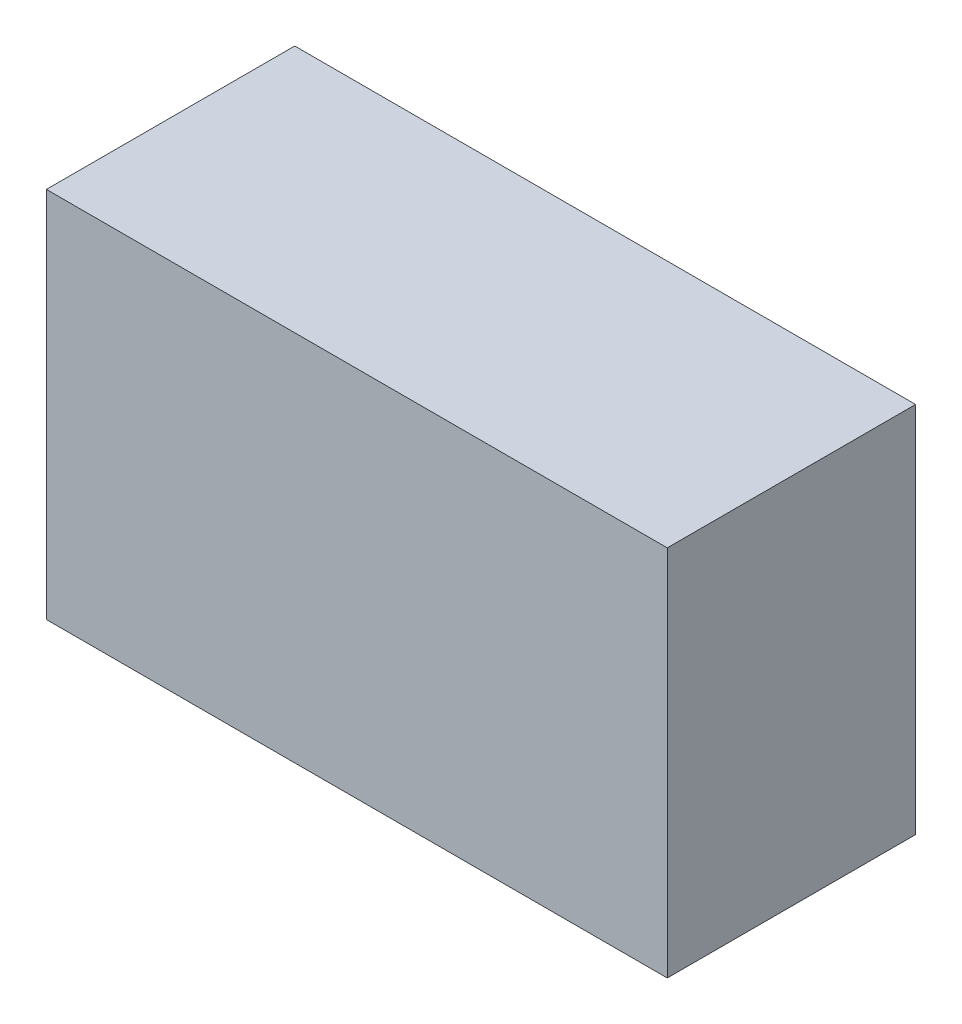
ISO-10303-21;
HEADER;
FILE_DESCRIPTION(('STEP AP214'),'2;1');
FILE_NAME('part.step','',(''),(''),'','','');
FILE_SCHEMA(('AUTOMOTIVE_DESIGN { 1 0 10303 214 1 1 1 1 }'));
ENDSEC;
DATA;
#1=APPLICATION_CONTEXT('core data for automotive mechanical design processes');
#2=APPLICATION_PROTOCOL_DEFINITION('international standard','automotive_design',2000,#1);
#3=PRODUCT_CONTEXT('',#1,'mechanical');
#4=PRODUCT('Part','Part','',(#3));
#5=PRODUCT_RELATED_PRODUCT_CATEGORY('part','',(#4));
#6=PRODUCT_DEFINITION_FORMATION('','',#4);
#7=PRODUCT_DEFINITION_CONTEXT('part definition',#1,'design');
#8=PRODUCT_DEFINITION('design','',#6,#7);
#9=PRODUCT_DEFINITION_SHAPE('','',#8);
#10=(LENGTH_UNIT() NAMED_UNIT(*) SI_UNIT(.MILLI.,.METRE.));
#11=(NAMED_UNIT(*) PLANE_ANGLE_UNIT() SI_UNIT($,.RADIAN.));
#12=(NAMED_UNIT(*) SI_UNIT($,.STERADIAN.) SOLID_ANGLE_UNIT());
#13=UNCERTAINTY_MEASURE_WITH_UNIT(LENGTH_MEASURE(1.E-05),#10,'distance_accuracy_value','');
#14=(GEOMETRIC_REPRESENTATION_CONTEXT(3) GLOBAL_UNCERTAINTY_ASSIGNED_CONTEXT((#13)) GLOBAL_UNIT_ASSIGNED_CONTEXT((#10,
#11,#12)) REPRESENTATION_CONTEXT('',''));
#15=CARTESIAN_POINT('',(0.,0.,0.));
#16=DIRECTION('',(0.,0.,1.));
#17=DIRECTION('',(1.,0.,0.));
#18=AXIS2_PLACEMENT_3D('',#15,#16,#17);
#19=CARTESIAN_POINT('',(-0.2499995,0.1499997,0.1999996));
#20=DIRECTION('',(0.,0.,-1.));
#21=DIRECTION('',(-1.,0.,0.));
#22=AXIS2_PLACEMENT_3D('',#19,#20,#21);
#23=PLANE('',#22);
#24=DIRECTION('',(1.,0.,0.));
#25=VECTOR('',#24,1.);
#26=CARTESIAN_POINT('',(-0.2499995,-0.1499997,0.1999996));
#27=LINE('',#26,#25);
#28=CARTESIAN_POINT('',(-0.2499995,-0.1499997,0.1999996));
#29=VERTEX_POINT('',#28);
#30=CARTESIAN_POINT('',(0.2499995,-0.1499997,0.1999996));
#31=VERTEX_POINT('',#30);
#32=EDGE_CURVE('E55',#29,#31,#27,.T.);
#33=ORIENTED_EDGE('',*,*,#32,.T.);
#34=DIRECTION('',(0.,1.,0.));
#35=VECTOR('',#34,1.);
#36=CARTESIAN_POINT('',(0.2499995,-0.1499997,0.1999996));
#37=LINE('',#36,#35);
#38=CARTESIAN_POINT('',(0.2499995,0.1499997,0.1999996));
#39=VERTEX_POINT('',#38);
#40=EDGE_CURVE('E57',#31,#39,#37,.T.);
#41=ORIENTED_EDGE('',*,*,#40,.T.);
#42=DIRECTION('',(1.,0.,0.));
#43=VECTOR('',#42,1.);
#44=CARTESIAN_POINT('',(0.2499995,0.1499997,0.1999996));
#45=LINE('',#44,#43);
#46=CARTESIAN_POINT('',(-0.2499995,0.1499997,0.1999996));
#47=VERTEX_POINT('',#46);
#48=EDGE_CURVE('E20',#39,#47,#45,.F.);
#49=ORIENTED_EDGE('',*,*,#48,.T.);
#50=DIRECTION('',(0.,1.,0.));
#51=VECTOR('',#50,1.);
#52=CARTESIAN_POINT('',(-0.2499995,0.1499997,0.1999996));
#53=LINE('',#52,#51);
#54=EDGE_CURVE('E80',#47,#29,#53,.F.);
#55=ORIENTED_EDGE('',*,*,#54,.T.);
#56=EDGE_LOOP('',(#33,#41,#49,#55));
#57=FACE_BOUND('',#56,.T.);
#58=ADVANCED_FACE('F17',(#57),#23,.F.);
#59=CARTESIAN_POINT('',(0.2499995,0.1499997,0.));
#60=DIRECTION('',(0.,-1.,0.));
#61=DIRECTION('',(0.,0.,-1.));
#62=AXIS2_PLACEMENT_3D('',#59,#60,#61);
#63=PLANE('',#62);
#64=DIRECTION('',(0.,0.,-1.));
#65=VECTOR('',#64,1.);
#66=CARTESIAN_POINT('',(-0.2499995,0.1499997,0.));
#67=LINE('',#66,#65);
#68=CARTESIAN_POINT('',(-0.2499995,0.1499997,0.));
#69=VERTEX_POINT('',#68);
#70=EDGE_CURVE('E68',#69,#47,#67,.F.);
#71=ORIENTED_EDGE('',*,*,#70,.T.);
#72=ORIENTED_EDGE('',*,*,#48,.F.);
#73=DIRECTION('',(0.,0.,1.));
#74=VECTOR('',#73,1.);
#75=CARTESIAN_POINT('',(0.2499995,0.1499997,0.));
#76=LINE('',#75,#74);
#77=CARTESIAN_POINT('',(0.2499995,0.1499997,0.));
#78=VERTEX_POINT('',#77);
#79=EDGE_CURVE('E63',#39,#78,#76,.F.);
#80=ORIENTED_EDGE('',*,*,#79,.T.);
#81=DIRECTION('',(-1.,0.,0.));
#82=VECTOR('',#81,1.);
#83=CARTESIAN_POINT('',(-0.2499995,0.1499997,0.));
#84=LINE('',#83,#82);
#85=EDGE_CURVE('E83',#69,#78,#84,.F.);
#86=ORIENTED_EDGE('',*,*,#85,.F.);
#87=EDGE_LOOP('',(#71,#72,#80,#86));
#88=FACE_BOUND('',#87,.T.);
#89=ADVANCED_FACE('F65',(#88),#63,.F.);
#90=CARTESIAN_POINT('',(0.2499995,-0.1499997,0.));
#91=DIRECTION('',(-1.,0.,0.));
#92=DIRECTION('',(0.,0.,1.));
#93=AXIS2_PLACEMENT_3D('',#90,#91,#92);
#94=PLANE('',#93);
#95=ORIENTED_EDGE('',*,*,#79,.F.);
#96=ORIENTED_EDGE('',*,*,#40,.F.);
#97=DIRECTION('',(0.,0.,1.));
#98=VECTOR('',#97,1.);
#99=CARTESIAN_POINT('',(0.2499995,-0.1499997,0.));
#100=LINE('',#99,#98);
#101=CARTESIAN_POINT('',(0.2499995,-0.1499997,0.));
#102=VERTEX_POINT('',#101);
#103=EDGE_CURVE('E75',#31,#102,#100,.F.);
#104=ORIENTED_EDGE('',*,*,#103,.T.);
#105=DIRECTION('',(0.,1.,0.));
#106=VECTOR('',#105,1.);
#107=CARTESIAN_POINT('',(0.2499995,0.1499997,0.));
#108=LINE('',#107,#106);
#109=EDGE_CURVE('E72',#78,#102,#108,.F.);
#110=ORIENTED_EDGE('',*,*,#109,.F.);
#111=EDGE_LOOP('',(#95,#96,#104,#110));
#112=FACE_BOUND('',#111,.T.);
#113=ADVANCED_FACE('F70',(#112),#94,.F.);
#114=CARTESIAN_POINT('',(-0.2499995,-0.1499997,0.));
#115=DIRECTION('',(0.,1.,0.));
#116=DIRECTION('',(0.,0.,1.));
#117=AXIS2_PLACEMENT_3D('',#114,#115,#116);
#118=PLANE('',#117);
#119=ORIENTED_EDGE('',*,*,#103,.F.);
#120=ORIENTED_EDGE('',*,*,#32,.F.);
#121=DIRECTION('',(0.,0.,-1.));
#122=VECTOR('',#121,1.);
#123=CARTESIAN_POINT('',(-0.2499995,-0.1499997,0.));
#124=LINE('',#123,#122);
#125=CARTESIAN_POINT('',(-0.2499995,-0.1499997,0.));
#126=VERTEX_POINT('',#125);
#127=EDGE_CURVE('E35',#29,#126,#124,.T.);
#128=ORIENTED_EDGE('',*,*,#127,.T.);
#129=DIRECTION('',(-1.,0.,0.));
#130=VECTOR('',#129,1.);
#131=CARTESIAN_POINT('',(-0.2499995,-0.1499997,0.));
#132=LINE('',#131,#130);
#133=EDGE_CURVE('E26',#102,#126,#132,.T.);
#134=ORIENTED_EDGE('',*,*,#133,.F.);
#135=EDGE_LOOP('',(#119,#120,#128,#134));
#136=FACE_BOUND('',#135,.T.);
#137=ADVANCED_FACE('F89',(#136),#118,.F.);
#138=CARTESIAN_POINT('',(-0.2499995,0.1499997,0.));
#139=DIRECTION('',(1.,0.,0.));
#140=DIRECTION('',(0.,0.,-1.));
#141=AXIS2_PLACEMENT_3D('',#138,#139,#140);
#142=PLANE('',#141);
#143=ORIENTED_EDGE('',*,*,#127,.F.);
#144=ORIENTED_EDGE('',*,*,#54,.F.);
#145=ORIENTED_EDGE('',*,*,#70,.F.);
#146=DIRECTION('',(0.,1.,0.));
#147=VECTOR('',#146,1.);
#148=CARTESIAN_POINT('',(-0.2499995,0.1499997,0.));
#149=LINE('',#148,#147);
#150=EDGE_CURVE('E11',#126,#69,#149,.T.);
#151=ORIENTED_EDGE('',*,*,#150,.F.);
#152=EDGE_LOOP('',(#143,#144,#145,#151));
#153=FACE_BOUND('',#152,.T.);
#154=ADVANCED_FACE('F91',(#153),#142,.F.);
#155=CARTESIAN_POINT('',(-0.2499995,0.1499997,0.));
#156=DIRECTION('',(0.,0.,-1.));
#157=DIRECTION('',(-1.,0.,0.));
#158=AXIS2_PLACEMENT_3D('',#155,#156,#157);
#159=PLANE('',#158);
#160=ORIENTED_EDGE('',*,*,#133,.T.);
#161=ORIENTED_EDGE('',*,*,#150,.T.);
#162=ORIENTED_EDGE('',*,*,#85,.T.);
#163=ORIENTED_EDGE('',*,*,#109,.T.);
#164=EDGE_LOOP('',(#160,#161,#162,#163));
#165=FACE_BOUND('',#164,.T.);
#166=ADVANCED_FACE('F88',(#165),#159,.T.);
#167=CLOSED_SHELL('',(#58,#89,#113,#137,#154,#166));
#168=MANIFOLD_SOLID_BREP('B1',#167);
#169=ADVANCED_BREP_SHAPE_REPRESENTATION('',(#18,#168),#14);
#170=SHAPE_DEFINITION_REPRESENTATION(#9,#169);
ENDSEC;
END-ISO-10303-21;
